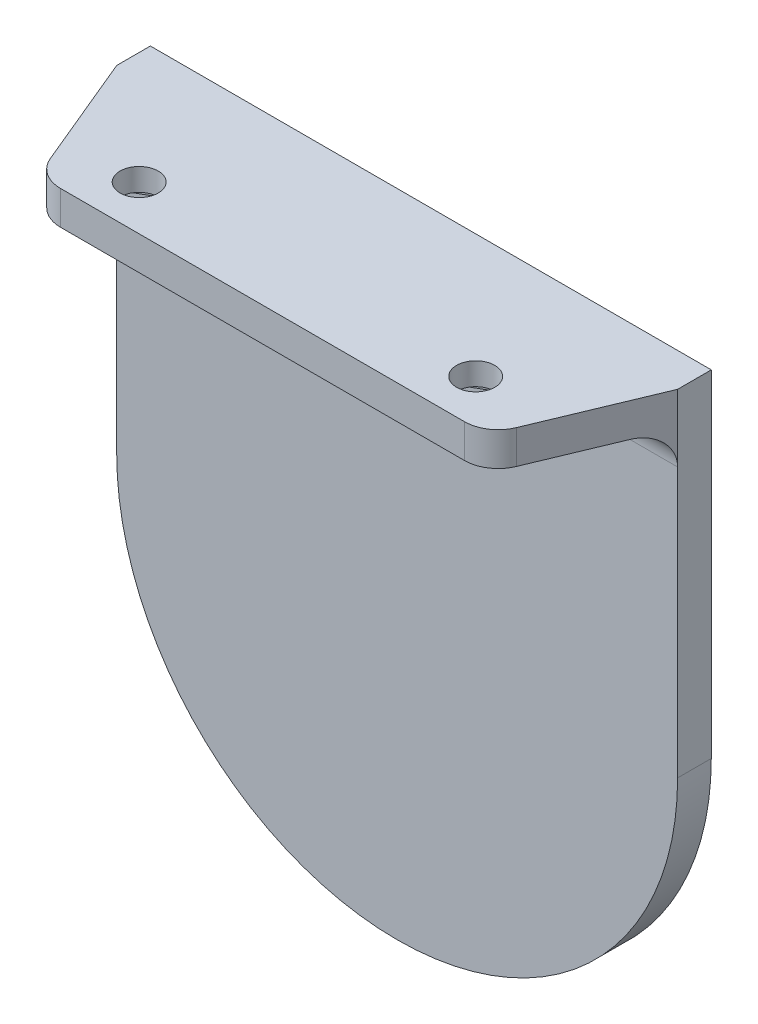
ISO-10303-21;
HEADER;
FILE_DESCRIPTION(('STEP AP214'),'2;1');
FILE_NAME('part.step','',(''),(''),'','','');
FILE_SCHEMA(('AUTOMOTIVE_DESIGN { 1 0 10303 214 1 1 1 1 }'));
ENDSEC;
DATA;
#1=APPLICATION_CONTEXT('core data for automotive mechanical design processes');
#2=APPLICATION_PROTOCOL_DEFINITION('international standard','automotive_design',2000,#1);
#3=PRODUCT_CONTEXT('',#1,'mechanical');
#4=PRODUCT('Part','Part','',(#3));
#5=PRODUCT_RELATED_PRODUCT_CATEGORY('part','',(#4));
#6=PRODUCT_DEFINITION_FORMATION('','',#4);
#7=PRODUCT_DEFINITION_CONTEXT('part definition',#1,'design');
#8=PRODUCT_DEFINITION('design','',#6,#7);
#9=PRODUCT_DEFINITION_SHAPE('','',#8);
#10=(LENGTH_UNIT() NAMED_UNIT(*) SI_UNIT(.MILLI.,.METRE.));
#11=(NAMED_UNIT(*) PLANE_ANGLE_UNIT() SI_UNIT($,.RADIAN.));
#12=(NAMED_UNIT(*) SI_UNIT($,.STERADIAN.) SOLID_ANGLE_UNIT());
#13=UNCERTAINTY_MEASURE_WITH_UNIT(LENGTH_MEASURE(1.E-05),#10,'distance_accuracy_value','');
#14=(GEOMETRIC_REPRESENTATION_CONTEXT(3) GLOBAL_UNCERTAINTY_ASSIGNED_CONTEXT((#13)) GLOBAL_UNIT_ASSIGNED_CONTEXT((#10,
#11,#12)) REPRESENTATION_CONTEXT('',''));
#15=CARTESIAN_POINT('',(0.,0.,0.));
#16=DIRECTION('',(0.,0.,1.));
#17=DIRECTION('',(1.,0.,0.));
#18=AXIS2_PLACEMENT_3D('',#15,#16,#17);
#19=CARTESIAN_POINT('',(880.,174.5,15.));
#20=DIRECTION('',(0.,0.,1.));
#21=DIRECTION('',(1.,0.,0.));
#22=AXIS2_PLACEMENT_3D('',#19,#20,#21);
#23=PLANE('',#22);
#24=DIRECTION('',(1.,0.,0.));
#25=VECTOR('',#24,1.);
#26=CARTESIAN_POINT('',(880.,174.5,15.));
#27=LINE('',#26,#25);
#28=CARTESIAN_POINT('',(882.,174.5,15.));
#29=VERTEX_POINT('',#28);
#30=CARTESIAN_POINT('',(918.,174.5,15.));
#31=VERTEX_POINT('',#30);
#32=EDGE_CURVE('E322',#29,#31,#27,.T.);
#33=ORIENTED_EDGE('',*,*,#32,.T.);
#34=DIRECTION('',(0.,1.,0.));
#35=VECTOR('',#34,1.);
#36=CARTESIAN_POINT('',(918.,174.5,15.));
#37=LINE('',#36,#35);
#38=CARTESIAN_POINT('',(918.,177.5,15.));
#39=VERTEX_POINT('',#38);
#40=EDGE_CURVE('E348',#31,#39,#37,.T.);
#41=ORIENTED_EDGE('',*,*,#40,.T.);
#42=DIRECTION('',(1.,0.,0.));
#43=VECTOR('',#42,1.);
#44=CARTESIAN_POINT('',(880.,177.5,15.));
#45=LINE('',#44,#43);
#46=CARTESIAN_POINT('',(882.,177.5,15.));
#47=VERTEX_POINT('',#46);
#48=EDGE_CURVE('E321',#47,#39,#45,.T.);
#49=ORIENTED_EDGE('',*,*,#48,.F.);
#50=DIRECTION('',(0.,1.,0.));
#51=VECTOR('',#50,1.);
#52=CARTESIAN_POINT('',(882.,174.5,15.));
#53=LINE('',#52,#51);
#54=EDGE_CURVE('E339',#47,#29,#53,.F.);
#55=ORIENTED_EDGE('',*,*,#54,.T.);
#56=EDGE_LOOP('',(#33,#41,#49,#55));
#57=FACE_BOUND('',#56,.T.);
#58=ADVANCED_FACE('F33',(#57),#23,.T.);
#59=CARTESIAN_POINT('',(875.,174.5,3.));
#60=DIRECTION('',(-0.923076923076923,0.,0.384615384615385));
#61=DIRECTION('',(0.384615384615385,0.,0.923076923076923));
#62=AXIS2_PLACEMENT_3D('',#59,#60,#61);
#63=PLANE('',#62);
#64=DIRECTION('',(0.384615384615385,0.,0.923076923076923));
#65=VECTOR('',#64,1.);
#66=CARTESIAN_POINT('',(875.,174.5,3.));
#67=LINE('',#66,#65);
#68=CARTESIAN_POINT('',(876.25,174.5,5.99999999999999));
#69=VERTEX_POINT('',#68);
#70=CARTESIAN_POINT('',(879.230769230769,174.5,13.1538461538462));
#71=VERTEX_POINT('',#70);
#72=EDGE_CURVE('E329',#69,#71,#67,.T.);
#73=ORIENTED_EDGE('',*,*,#72,.T.);
#74=DIRECTION('',(0.,1.,0.));
#75=VECTOR('',#74,1.);
#76=CARTESIAN_POINT('',(879.230769230769,174.5,13.1538461538462));
#77=LINE('',#76,#75);
#78=CARTESIAN_POINT('',(879.230769230769,177.5,13.1538461538462));
#79=VERTEX_POINT('',#78);
#80=EDGE_CURVE('E366',#71,#79,#77,.T.);
#81=ORIENTED_EDGE('',*,*,#80,.T.);
#82=DIRECTION('',(0.384615384615385,0.,0.923076923076923));
#83=VECTOR('',#82,1.);
#84=CARTESIAN_POINT('',(875.,177.5,3.));
#85=LINE('',#84,#83);
#86=CARTESIAN_POINT('',(875.,177.5,3.));
#87=VERTEX_POINT('',#86);
#88=EDGE_CURVE('E326',#87,#79,#85,.T.);
#89=ORIENTED_EDGE('',*,*,#88,.F.);
#90=DIRECTION('',(0.,1.,0.));
#91=VECTOR('',#90,1.);
#92=CARTESIAN_POINT('',(875.,174.5,3.));
#93=LINE('',#92,#91);
#94=CARTESIAN_POINT('',(875.,171.5,3.));
#95=VERTEX_POINT('',#94);
#96=EDGE_CURVE('E56',#95,#87,#93,.T.);
#97=ORIENTED_EDGE('',*,*,#96,.F.);
#98=CARTESIAN_POINT('',(876.25,171.5,6.));
#99=DIRECTION('',(-0.923076923076923,0.,0.384615384615385));
#100=DIRECTION('',(-0.384615384615385,0.,-0.923076923076923));
#101=AXIS2_PLACEMENT_3D('',#98,#99,#100);
#102=ELLIPSE('',#101,3.25,3.);
#103=EDGE_CURVE('E41',#95,#69,#102,.F.);
#104=ORIENTED_EDGE('',*,*,#103,.T.);
#105=EDGE_LOOP('',(#73,#81,#89,#97,#104));
#106=FACE_BOUND('',#105,.T.);
#107=ADVANCED_FACE('F369',(#106),#63,.T.);
#108=CARTESIAN_POINT('',(920.,174.5,15.));
#109=DIRECTION('',(0.923076923076923,0.,0.384615384615385));
#110=DIRECTION('',(0.384615384615385,0.,-0.923076923076923));
#111=AXIS2_PLACEMENT_3D('',#108,#109,#110);
#112=PLANE('',#111);
#113=DIRECTION('',(0.384615384615385,0.,-0.923076923076923));
#114=VECTOR('',#113,1.);
#115=CARTESIAN_POINT('',(920.,177.5,15.));
#116=LINE('',#115,#114);
#117=CARTESIAN_POINT('',(920.769230769231,177.5,13.1538461538462));
#118=VERTEX_POINT('',#117);
#119=CARTESIAN_POINT('',(925.,177.5,3.));
#120=VERTEX_POINT('',#119);
#121=EDGE_CURVE('E334',#118,#120,#116,.T.);
#122=ORIENTED_EDGE('',*,*,#121,.F.);
#123=DIRECTION('',(0.,1.,0.));
#124=VECTOR('',#123,1.);
#125=CARTESIAN_POINT('',(920.769230769231,174.5,13.1538461538462));
#126=LINE('',#125,#124);
#127=CARTESIAN_POINT('',(920.769230769231,174.5,13.1538461538462));
#128=VERTEX_POINT('',#127);
#129=EDGE_CURVE('E355',#118,#128,#126,.F.);
#130=ORIENTED_EDGE('',*,*,#129,.T.);
#131=DIRECTION('',(0.384615384615385,0.,-0.923076923076923));
#132=VECTOR('',#131,1.);
#133=CARTESIAN_POINT('',(920.,174.5,15.));
#134=LINE('',#133,#132);
#135=CARTESIAN_POINT('',(923.75,174.5,5.99999999999999));
#136=VERTEX_POINT('',#135);
#137=EDGE_CURVE('E325',#128,#136,#134,.T.);
#138=ORIENTED_EDGE('',*,*,#137,.T.);
#139=CARTESIAN_POINT('',(923.75,171.5,6.));
#140=DIRECTION('',(0.923076923076923,0.,0.384615384615385));
#141=DIRECTION('',(-0.384615384615385,0.,0.923076923076923));
#142=AXIS2_PLACEMENT_3D('',#139,#140,#141);
#143=ELLIPSE('',#142,3.25,3.);
#144=CARTESIAN_POINT('',(925.,171.5,3.));
#145=VERTEX_POINT('',#144);
#146=EDGE_CURVE('E11',#136,#145,#143,.F.);
#147=ORIENTED_EDGE('',*,*,#146,.T.);
#148=DIRECTION('',(0.,1.,0.));
#149=VECTOR('',#148,1.);
#150=CARTESIAN_POINT('',(925.,174.5,3.));
#151=LINE('',#150,#149);
#152=EDGE_CURVE('E48',#145,#120,#151,.T.);
#153=ORIENTED_EDGE('',*,*,#152,.T.);
#154=EDGE_LOOP('',(#122,#130,#138,#147,#153));
#155=FACE_BOUND('',#154,.T.);
#156=ADVANCED_FACE('F383',(#155),#112,.T.);
#157=CARTESIAN_POINT('',(0.,174.5,0.));
#158=DIRECTION('',(0.,1.,0.));
#159=DIRECTION('',(0.,0.,1.));
#160=AXIS2_PLACEMENT_3D('',#157,#158,#159);
#161=PLANE('',#160);
#162=DIRECTION('',(0.866025403784425,0.,-0.500000000000023));
#163=VECTOR('',#162,1.);
#164=CARTESIAN_POINT('',(882.142116167512,174.5,9.35));
#165=LINE('',#164,#163);
#166=CARTESIAN_POINT('',(882.142116167512,174.5,9.35000000000008));
#167=VERTEX_POINT('',#166);
#168=CARTESIAN_POINT('',(885.,174.5,7.70000000000029));
#169=VERTEX_POINT('',#168);
#170=EDGE_CURVE('E225',#167,#169,#165,.T.);
#171=ORIENTED_EDGE('',*,*,#170,.F.);
#172=DIRECTION('',(0.,0.,-1.));
#173=VECTOR('',#172,1.);
#174=CARTESIAN_POINT('',(882.142116167512,174.5,12.6500000000001));
#175=LINE('',#174,#173);
#176=CARTESIAN_POINT('',(882.142116167512,174.5,12.6500000000001));
#177=VERTEX_POINT('',#176);
#178=EDGE_CURVE('E190',#177,#167,#175,.T.);
#179=ORIENTED_EDGE('',*,*,#178,.F.);
#180=DIRECTION('',(-0.866025403784435,0.,-0.500000000000007));
#181=VECTOR('',#180,1.);
#182=CARTESIAN_POINT('',(885.,174.5,14.2999999999998));
#183=LINE('',#182,#181);
#184=CARTESIAN_POINT('',(885.,174.5,14.2999999999998));
#185=VERTEX_POINT('',#184);
#186=EDGE_CURVE('E208',#185,#177,#183,.T.);
#187=ORIENTED_EDGE('',*,*,#186,.F.);
#188=DIRECTION('',(-0.866025403784495,0.,0.499999999999903));
#189=VECTOR('',#188,1.);
#190=CARTESIAN_POINT('',(887.857883832489,174.5,12.65));
#191=LINE('',#190,#189);
#192=CARTESIAN_POINT('',(887.857883832489,174.5,12.65));
#193=VERTEX_POINT('',#192);
#194=EDGE_CURVE('E211',#193,#185,#191,.T.);
#195=ORIENTED_EDGE('',*,*,#194,.F.);
#196=DIRECTION('',(0.,0.,1.));
#197=VECTOR('',#196,1.);
#198=CARTESIAN_POINT('',(887.857883832489,174.5,9.35));
#199=LINE('',#198,#197);
#200=CARTESIAN_POINT('',(887.857883832489,174.5,9.35));
#201=VERTEX_POINT('',#200);
#202=EDGE_CURVE('E231',#201,#193,#199,.T.);
#203=ORIENTED_EDGE('',*,*,#202,.F.);
#204=DIRECTION('',(0.866025403784501,0.,0.499999999999892));
#205=VECTOR('',#204,1.);
#206=CARTESIAN_POINT('',(885.,174.5,7.70000000000029));
#207=LINE('',#206,#205);
#208=EDGE_CURVE('E228',#169,#201,#207,.T.);
#209=ORIENTED_EDGE('',*,*,#208,.F.);
#210=EDGE_LOOP('',(#171,#179,#187,#195,#203,#209));
#211=FACE_BOUND('',#210,.T.);
#212=DIRECTION('',(0.,0.,-1.));
#213=VECTOR('',#212,1.);
#214=CARTESIAN_POINT('',(912.142116167512,174.5,12.65));
#215=LINE('',#214,#213);
#216=CARTESIAN_POINT('',(912.142116167512,174.5,12.65));
#217=VERTEX_POINT('',#216);
#218=CARTESIAN_POINT('',(912.142116167512,174.5,9.35));
#219=VERTEX_POINT('',#218);
#220=EDGE_CURVE('E267',#217,#219,#215,.T.);
#221=ORIENTED_EDGE('',*,*,#220,.F.);
#222=DIRECTION('',(-0.86602540378443,0.,-0.500000000000015));
#223=VECTOR('',#222,1.);
#224=CARTESIAN_POINT('',(915.,174.5,14.2999999999997));
#225=LINE('',#224,#223);
#226=CARTESIAN_POINT('',(915.,174.5,14.2999999999997));
#227=VERTEX_POINT('',#226);
#228=EDGE_CURVE('E238',#227,#217,#225,.T.);
#229=ORIENTED_EDGE('',*,*,#228,.F.);
#230=DIRECTION('',(-0.866025403784401,0.,0.500000000000066));
#231=VECTOR('',#230,1.);
#232=CARTESIAN_POINT('',(917.857883832488,174.5,12.6499999999998));
#233=LINE('',#232,#231);
#234=CARTESIAN_POINT('',(917.857883832488,174.5,12.6499999999998));
#235=VERTEX_POINT('',#234);
#236=EDGE_CURVE('E250',#235,#227,#233,.T.);
#237=ORIENTED_EDGE('',*,*,#236,.F.);
#238=DIRECTION('',(0.,0.,1.));
#239=VECTOR('',#238,1.);
#240=CARTESIAN_POINT('',(917.857883832488,174.5,9.35));
#241=LINE('',#240,#239);
#242=CARTESIAN_POINT('',(917.857883832488,174.5,9.35));
#243=VERTEX_POINT('',#242);
#244=EDGE_CURVE('E276',#243,#235,#241,.T.);
#245=ORIENTED_EDGE('',*,*,#244,.F.);
#246=DIRECTION('',(0.86602540378441,0.,0.50000000000005));
#247=VECTOR('',#246,1.);
#248=CARTESIAN_POINT('',(915.,174.5,7.70000000000017));
#249=LINE('',#248,#247);
#250=CARTESIAN_POINT('',(915.,174.5,7.70000000000017));
#251=VERTEX_POINT('',#250);
#252=EDGE_CURVE('E273',#251,#243,#249,.T.);
#253=ORIENTED_EDGE('',*,*,#252,.F.);
#254=DIRECTION('',(0.866025403784418,0.,-0.500000000000035));
#255=VECTOR('',#254,1.);
#256=CARTESIAN_POINT('',(912.142116167512,174.5,9.35));
#257=LINE('',#256,#255);
#258=EDGE_CURVE('E270',#219,#251,#257,.T.);
#259=ORIENTED_EDGE('',*,*,#258,.F.);
#260=EDGE_LOOP('',(#221,#229,#237,#245,#253,#259));
#261=FACE_BOUND('',#260,.T.);
#262=ORIENTED_EDGE('',*,*,#137,.F.);
#263=CARTESIAN_POINT('',(918.,174.5,12.));
#264=DIRECTION('',(0.,1.,0.));
#265=DIRECTION('',(0.,0.,1.));
#266=AXIS2_PLACEMENT_3D('',#263,#264,#265);
#267=CIRCLE('',#266,3.);
#268=EDGE_CURVE('E361',#128,#31,#267,.F.);
#269=ORIENTED_EDGE('',*,*,#268,.T.);
#270=ORIENTED_EDGE('',*,*,#32,.F.);
#271=CARTESIAN_POINT('',(882.,174.5,12.));
#272=DIRECTION('',(0.,1.,0.));
#273=DIRECTION('',(0.,0.,1.));
#274=AXIS2_PLACEMENT_3D('',#271,#272,#273);
#275=CIRCLE('',#274,3.);
#276=EDGE_CURVE('E357',#29,#71,#275,.F.);
#277=ORIENTED_EDGE('',*,*,#276,.T.);
#278=ORIENTED_EDGE('',*,*,#72,.F.);
#279=DIRECTION('',(-1.,0.,0.));
#280=VECTOR('',#279,1.);
#281=CARTESIAN_POINT('',(0.,174.5,6.));
#282=LINE('',#281,#280);
#283=EDGE_CURVE('E359',#69,#136,#282,.F.);
#284=ORIENTED_EDGE('',*,*,#283,.T.);
#285=EDGE_LOOP('',(#262,#269,#270,#277,#278,#284));
#286=FACE_BOUND('',#285,.T.);
#287=ADVANCED_FACE('F376',(#211,#261,#286),#161,.F.);
#288=CARTESIAN_POINT('',(0.,177.5,0.));
#289=DIRECTION('',(0.,1.,0.));
#290=DIRECTION('',(0.,0.,1.));
#291=AXIS2_PLACEMENT_3D('',#288,#289,#290);
#292=PLANE('',#291);
#293=CARTESIAN_POINT('',(885.,177.5,11.));
#294=DIRECTION('',(0.,1.,0.));
#295=DIRECTION('',(0.,0.,1.));
#296=AXIS2_PLACEMENT_3D('',#293,#294,#295);
#297=CIRCLE('',#296,1.70000000000003);
#298=CARTESIAN_POINT('',(885.,177.5,12.7));
#299=VERTEX_POINT('',#298);
#300=EDGE_CURVE('E346',#299,#299,#297,.T.);
#301=ORIENTED_EDGE('',*,*,#300,.F.);
#302=EDGE_LOOP('',(#301));
#303=FACE_BOUND('',#302,.T.);
#304=CARTESIAN_POINT('',(915.,177.5,11.));
#305=DIRECTION('',(0.,1.,0.));
#306=DIRECTION('',(0.,0.,1.));
#307=AXIS2_PLACEMENT_3D('',#304,#305,#306);
#308=CIRCLE('',#307,1.70000000000003);
#309=CARTESIAN_POINT('',(915.,177.5,12.7));
#310=VERTEX_POINT('',#309);
#311=EDGE_CURVE('E214',#310,#310,#308,.T.);
#312=ORIENTED_EDGE('',*,*,#311,.F.);
#313=EDGE_LOOP('',(#312));
#314=FACE_BOUND('',#313,.T.);
#315=ORIENTED_EDGE('',*,*,#48,.T.);
#316=CARTESIAN_POINT('',(918.,177.5,12.));
#317=DIRECTION('',(0.,1.,0.));
#318=DIRECTION('',(0.,0.,1.));
#319=AXIS2_PLACEMENT_3D('',#316,#317,#318);
#320=CIRCLE('',#319,3.);
#321=EDGE_CURVE('E353',#39,#118,#320,.T.);
#322=ORIENTED_EDGE('',*,*,#321,.T.);
#323=ORIENTED_EDGE('',*,*,#121,.T.);
#324=DIRECTION('',(0.,0.,1.));
#325=VECTOR('',#324,1.);
#326=CARTESIAN_POINT('',(925.,177.5,0.));
#327=LINE('',#326,#325);
#328=CARTESIAN_POINT('',(925.,177.5,0.));
#329=VERTEX_POINT('',#328);
#330=EDGE_CURVE('E313',#329,#120,#327,.T.);
#331=ORIENTED_EDGE('',*,*,#330,.F.);
#332=DIRECTION('',(1.,0.,0.));
#333=VECTOR('',#332,1.);
#334=CARTESIAN_POINT('',(925.,177.5,0.));
#335=LINE('',#334,#333);
#336=CARTESIAN_POINT('',(875.,177.5,0.));
#337=VERTEX_POINT('',#336);
#338=EDGE_CURVE('E300',#337,#329,#335,.T.);
#339=ORIENTED_EDGE('',*,*,#338,.F.);
#340=DIRECTION('',(0.,0.,1.));
#341=VECTOR('',#340,1.);
#342=CARTESIAN_POINT('',(875.,177.5,0.));
#343=LINE('',#342,#341);
#344=EDGE_CURVE('E315',#337,#87,#343,.T.);
#345=ORIENTED_EDGE('',*,*,#344,.T.);
#346=ORIENTED_EDGE('',*,*,#88,.T.);
#347=CARTESIAN_POINT('',(882.,177.5,12.));
#348=DIRECTION('',(0.,1.,0.));
#349=DIRECTION('',(0.,0.,1.));
#350=AXIS2_PLACEMENT_3D('',#347,#348,#349);
#351=CIRCLE('',#350,3.);
#352=EDGE_CURVE('E351',#79,#47,#351,.T.);
#353=ORIENTED_EDGE('',*,*,#352,.T.);
#354=EDGE_LOOP('',(#315,#322,#323,#331,#339,#345,#346,#353));
#355=FACE_BOUND('',#354,.T.);
#356=ADVANCED_FACE('F393',(#303,#314,#355),#292,.T.);
#357=CARTESIAN_POINT('',(900.,147.5,0.));
#358=DIRECTION('',(0.,0.,1.));
#359=DIRECTION('',(1.,0.,0.));
#360=AXIS2_PLACEMENT_3D('',#357,#358,#359);
#361=CYLINDRICAL_SURFACE('',#360,25.);
#362=CARTESIAN_POINT('',(900.,147.5,3.));
#363=DIRECTION('',(0.,0.,-1.));
#364=DIRECTION('',(1.,0.,0.));
#365=AXIS2_PLACEMENT_3D('',#362,#363,#364);
#366=CIRCLE('',#365,25.);
#367=CARTESIAN_POINT('',(925.,147.5,3.));
#368=VERTEX_POINT('',#367);
#369=CARTESIAN_POINT('',(875.,147.5,3.));
#370=VERTEX_POINT('',#369);
#371=EDGE_CURVE('E283',#368,#370,#366,.T.);
#372=ORIENTED_EDGE('',*,*,#371,.T.);
#373=DIRECTION('',(0.,0.,1.));
#374=VECTOR('',#373,1.);
#375=CARTESIAN_POINT('',(875.,147.5,0.));
#376=LINE('',#375,#374);
#377=CARTESIAN_POINT('',(875.,147.5,0.));
#378=VERTEX_POINT('',#377);
#379=EDGE_CURVE('E318',#378,#370,#376,.T.);
#380=ORIENTED_EDGE('',*,*,#379,.F.);
#381=CARTESIAN_POINT('',(900.,147.5,0.));
#382=DIRECTION('',(0.,0.,-1.));
#383=DIRECTION('',(1.,0.,0.));
#384=AXIS2_PLACEMENT_3D('',#381,#382,#383);
#385=CIRCLE('',#384,25.);
#386=CARTESIAN_POINT('',(925.,147.5,0.));
#387=VERTEX_POINT('',#386);
#388=EDGE_CURVE('E294',#387,#378,#385,.T.);
#389=ORIENTED_EDGE('',*,*,#388,.F.);
#390=DIRECTION('',(0.,0.,1.));
#391=VECTOR('',#390,1.);
#392=CARTESIAN_POINT('',(925.,147.5,0.));
#393=LINE('',#392,#391);
#394=EDGE_CURVE('E304',#387,#368,#393,.T.);
#395=ORIENTED_EDGE('',*,*,#394,.T.);
#396=EDGE_LOOP('',(#372,#380,#389,#395));
#397=FACE_BOUND('',#396,.T.);
#398=ADVANCED_FACE('F408',(#397),#361,.T.);
#399=CARTESIAN_POINT('',(875.,177.5,0.));
#400=DIRECTION('',(1.,0.,0.));
#401=DIRECTION('',(0.,0.,-1.));
#402=AXIS2_PLACEMENT_3D('',#399,#400,#401);
#403=PLANE('',#402);
#404=DIRECTION('',(0.,1.,0.));
#405=VECTOR('',#404,1.);
#406=CARTESIAN_POINT('',(875.,177.5,3.));
#407=LINE('',#406,#405);
#408=EDGE_CURVE('E307',#370,#95,#407,.T.);
#409=ORIENTED_EDGE('',*,*,#408,.T.);
#410=ORIENTED_EDGE('',*,*,#96,.T.);
#411=ORIENTED_EDGE('',*,*,#344,.F.);
#412=DIRECTION('',(0.,1.,0.));
#413=VECTOR('',#412,1.);
#414=CARTESIAN_POINT('',(875.,177.5,0.));
#415=LINE('',#414,#413);
#416=EDGE_CURVE('E297',#378,#337,#415,.T.);
#417=ORIENTED_EDGE('',*,*,#416,.F.);
#418=ORIENTED_EDGE('',*,*,#379,.T.);
#419=EDGE_LOOP('',(#409,#410,#411,#417,#418));
#420=FACE_BOUND('',#419,.T.);
#421=ADVANCED_FACE('F397',(#420),#403,.F.);
#422=CARTESIAN_POINT('',(925.,147.5,0.));
#423=DIRECTION('',(-1.,0.,0.));
#424=DIRECTION('',(0.,0.,1.));
#425=AXIS2_PLACEMENT_3D('',#422,#423,#424);
#426=PLANE('',#425);
#427=ORIENTED_EDGE('',*,*,#152,.F.);
#428=DIRECTION('',(0.,-1.,0.));
#429=VECTOR('',#428,1.);
#430=CARTESIAN_POINT('',(925.,147.5,3.));
#431=LINE('',#430,#429);
#432=EDGE_CURVE('E298',#145,#368,#431,.T.);
#433=ORIENTED_EDGE('',*,*,#432,.T.);
#434=ORIENTED_EDGE('',*,*,#394,.F.);
#435=DIRECTION('',(0.,-1.,0.));
#436=VECTOR('',#435,1.);
#437=CARTESIAN_POINT('',(925.,147.5,0.));
#438=LINE('',#437,#436);
#439=EDGE_CURVE('E302',#329,#387,#438,.T.);
#440=ORIENTED_EDGE('',*,*,#439,.F.);
#441=ORIENTED_EDGE('',*,*,#330,.T.);
#442=EDGE_LOOP('',(#427,#433,#434,#440,#441));
#443=FACE_BOUND('',#442,.T.);
#444=ADVANCED_FACE('F411',(#443),#426,.F.);
#445=CARTESIAN_POINT('',(900.,147.5,0.));
#446=DIRECTION('',(0.,0.,1.));
#447=DIRECTION('',(1.,0.,0.));
#448=AXIS2_PLACEMENT_3D('',#445,#446,#447);
#449=PLANE('',#448);
#450=ORIENTED_EDGE('',*,*,#388,.T.);
#451=ORIENTED_EDGE('',*,*,#416,.T.);
#452=ORIENTED_EDGE('',*,*,#338,.T.);
#453=ORIENTED_EDGE('',*,*,#439,.T.);
#454=EDGE_LOOP('',(#450,#451,#452,#453));
#455=FACE_BOUND('',#454,.T.);
#456=ADVANCED_FACE('F402',(#455),#449,.F.);
#457=CARTESIAN_POINT('',(900.,147.5,3.));
#458=DIRECTION('',(0.,0.,1.));
#459=DIRECTION('',(1.,0.,0.));
#460=AXIS2_PLACEMENT_3D('',#457,#458,#459);
#461=PLANE('',#460);
#462=ORIENTED_EDGE('',*,*,#432,.F.);
#463=DIRECTION('',(-1.,0.,0.));
#464=VECTOR('',#463,1.);
#465=CARTESIAN_POINT('',(900.,171.5,3.));
#466=LINE('',#465,#464);
#467=EDGE_CURVE('E363',#145,#95,#466,.T.);
#468=ORIENTED_EDGE('',*,*,#467,.T.);
#469=ORIENTED_EDGE('',*,*,#408,.F.);
#470=ORIENTED_EDGE('',*,*,#371,.F.);
#471=EDGE_LOOP('',(#462,#468,#469,#470));
#472=FACE_BOUND('',#471,.T.);
#473=ADVANCED_FACE('F410',(#472),#461,.T.);
#474=CARTESIAN_POINT('',(915.,175.5,14.2999999999997));
#475=DIRECTION('',(-0.500000000000015,0.,0.86602540378443));
#476=DIRECTION('',(0.86602540378443,0.,0.500000000000015));
#477=AXIS2_PLACEMENT_3D('',#474,#475,#476);
#478=PLANE('',#477);
#479=ORIENTED_EDGE('',*,*,#228,.T.);
#480=DIRECTION('',(0.,-1.,0.));
#481=VECTOR('',#480,1.);
#482=CARTESIAN_POINT('',(912.142116167512,175.5,12.65));
#483=LINE('',#482,#481);
#484=CARTESIAN_POINT('',(912.142116167512,175.5,12.65));
#485=VERTEX_POINT('',#484);
#486=EDGE_CURVE('E265',#485,#217,#483,.T.);
#487=ORIENTED_EDGE('',*,*,#486,.F.);
#488=DIRECTION('',(-0.86602540378443,0.,-0.500000000000015));
#489=VECTOR('',#488,1.);
#490=CARTESIAN_POINT('',(915.,175.5,14.2999999999997));
#491=LINE('',#490,#489);
#492=CARTESIAN_POINT('',(915.,175.5,14.2999999999997));
#493=VERTEX_POINT('',#492);
#494=EDGE_CURVE('E246',#493,#485,#491,.T.);
#495=ORIENTED_EDGE('',*,*,#494,.F.);
#496=DIRECTION('',(0.,-1.,0.));
#497=VECTOR('',#496,1.);
#498=CARTESIAN_POINT('',(915.,175.5,14.2999999999997));
#499=LINE('',#498,#497);
#500=EDGE_CURVE('E281',#493,#227,#499,.T.);
#501=ORIENTED_EDGE('',*,*,#500,.T.);
#502=EDGE_LOOP('',(#479,#487,#495,#501));
#503=FACE_BOUND('',#502,.T.);
#504=ADVANCED_FACE('F457',(#503),#478,.F.);
#505=CARTESIAN_POINT('',(917.857883832488,175.5,12.6499999999998));
#506=DIRECTION('',(0.500000000000066,0.,0.866025403784401));
#507=DIRECTION('',(0.866025403784401,0.,-0.500000000000066));
#508=AXIS2_PLACEMENT_3D('',#505,#506,#507);
#509=PLANE('',#508);
#510=ORIENTED_EDGE('',*,*,#236,.T.);
#511=ORIENTED_EDGE('',*,*,#500,.F.);
#512=DIRECTION('',(-0.866025403784401,0.,0.500000000000066));
#513=VECTOR('',#512,1.);
#514=CARTESIAN_POINT('',(917.857883832488,175.5,12.6499999999998));
#515=LINE('',#514,#513);
#516=CARTESIAN_POINT('',(917.857883832488,175.5,12.6499999999998));
#517=VERTEX_POINT('',#516);
#518=EDGE_CURVE('E262',#517,#493,#515,.T.);
#519=ORIENTED_EDGE('',*,*,#518,.F.);
#520=DIRECTION('',(0.,-1.,0.));
#521=VECTOR('',#520,1.);
#522=CARTESIAN_POINT('',(917.857883832488,175.5,12.6499999999998));
#523=LINE('',#522,#521);
#524=EDGE_CURVE('E284',#517,#235,#523,.T.);
#525=ORIENTED_EDGE('',*,*,#524,.T.);
#526=EDGE_LOOP('',(#510,#511,#519,#525));
#527=FACE_BOUND('',#526,.T.);
#528=ADVANCED_FACE('F640',(#527),#509,.F.);
#529=CARTESIAN_POINT('',(917.857883832488,175.5,9.35));
#530=DIRECTION('',(1.,0.,0.));
#531=DIRECTION('',(0.,0.,-1.));
#532=AXIS2_PLACEMENT_3D('',#529,#530,#531);
#533=PLANE('',#532);
#534=ORIENTED_EDGE('',*,*,#244,.T.);
#535=ORIENTED_EDGE('',*,*,#524,.F.);
#536=DIRECTION('',(0.,0.,1.));
#537=VECTOR('',#536,1.);
#538=CARTESIAN_POINT('',(917.857883832488,175.5,9.35));
#539=LINE('',#538,#537);
#540=CARTESIAN_POINT('',(917.857883832488,175.5,9.35));
#541=VERTEX_POINT('',#540);
#542=EDGE_CURVE('E259',#541,#517,#539,.T.);
#543=ORIENTED_EDGE('',*,*,#542,.F.);
#544=DIRECTION('',(0.,-1.,0.));
#545=VECTOR('',#544,1.);
#546=CARTESIAN_POINT('',(917.857883832488,175.5,9.35));
#547=LINE('',#546,#545);
#548=EDGE_CURVE('E286',#541,#243,#547,.T.);
#549=ORIENTED_EDGE('',*,*,#548,.T.);
#550=EDGE_LOOP('',(#534,#535,#543,#549));
#551=FACE_BOUND('',#550,.T.);
#552=ADVANCED_FACE('F630',(#551),#533,.F.);
#553=CARTESIAN_POINT('',(915.,175.5,7.70000000000017));
#554=DIRECTION('',(0.50000000000005,0.,-0.86602540378441));
#555=DIRECTION('',(-0.86602540378441,0.,-0.50000000000005));
#556=AXIS2_PLACEMENT_3D('',#553,#554,#555);
#557=PLANE('',#556);
#558=ORIENTED_EDGE('',*,*,#252,.T.);
#559=ORIENTED_EDGE('',*,*,#548,.F.);
#560=DIRECTION('',(0.86602540378441,0.,0.50000000000005));
#561=VECTOR('',#560,1.);
#562=CARTESIAN_POINT('',(915.,175.5,7.70000000000017));
#563=LINE('',#562,#561);
#564=CARTESIAN_POINT('',(915.,175.5,7.70000000000017));
#565=VERTEX_POINT('',#564);
#566=EDGE_CURVE('E256',#565,#541,#563,.T.);
#567=ORIENTED_EDGE('',*,*,#566,.F.);
#568=DIRECTION('',(0.,-1.,0.));
#569=VECTOR('',#568,1.);
#570=CARTESIAN_POINT('',(915.,175.5,7.70000000000017));
#571=LINE('',#570,#569);
#572=EDGE_CURVE('E288',#565,#251,#571,.T.);
#573=ORIENTED_EDGE('',*,*,#572,.T.);
#574=EDGE_LOOP('',(#558,#559,#567,#573));
#575=FACE_BOUND('',#574,.T.);
#576=ADVANCED_FACE('F620',(#575),#557,.F.);
#577=CARTESIAN_POINT('',(912.142116167512,175.5,9.35));
#578=DIRECTION('',(-0.500000000000035,0.,-0.866025403784418));
#579=DIRECTION('',(-0.866025403784418,0.,0.500000000000035));
#580=AXIS2_PLACEMENT_3D('',#577,#578,#579);
#581=PLANE('',#580);
#582=ORIENTED_EDGE('',*,*,#258,.T.);
#583=ORIENTED_EDGE('',*,*,#572,.F.);
#584=DIRECTION('',(0.866025403784418,0.,-0.500000000000035));
#585=VECTOR('',#584,1.);
#586=CARTESIAN_POINT('',(912.142116167512,175.5,9.35));
#587=LINE('',#586,#585);
#588=CARTESIAN_POINT('',(912.142116167512,175.5,9.35));
#589=VERTEX_POINT('',#588);
#590=EDGE_CURVE('E253',#589,#565,#587,.T.);
#591=ORIENTED_EDGE('',*,*,#590,.F.);
#592=DIRECTION('',(0.,-1.,0.));
#593=VECTOR('',#592,1.);
#594=CARTESIAN_POINT('',(912.142116167512,175.5,9.35));
#595=LINE('',#594,#593);
#596=EDGE_CURVE('E290',#589,#219,#595,.T.);
#597=ORIENTED_EDGE('',*,*,#596,.T.);
#598=EDGE_LOOP('',(#582,#583,#591,#597));
#599=FACE_BOUND('',#598,.T.);
#600=ADVANCED_FACE('F610',(#599),#581,.F.);
#601=CARTESIAN_POINT('',(912.142116167512,175.5,12.65));
#602=DIRECTION('',(-1.,0.,0.));
#603=DIRECTION('',(0.,0.,1.));
#604=AXIS2_PLACEMENT_3D('',#601,#602,#603);
#605=PLANE('',#604);
#606=ORIENTED_EDGE('',*,*,#220,.T.);
#607=ORIENTED_EDGE('',*,*,#596,.F.);
#608=DIRECTION('',(0.,0.,-1.));
#609=VECTOR('',#608,1.);
#610=CARTESIAN_POINT('',(912.142116167512,175.5,12.65));
#611=LINE('',#610,#609);
#612=EDGE_CURVE('E249',#485,#589,#611,.T.);
#613=ORIENTED_EDGE('',*,*,#612,.F.);
#614=ORIENTED_EDGE('',*,*,#486,.T.);
#615=EDGE_LOOP('',(#606,#607,#613,#614));
#616=FACE_BOUND('',#615,.T.);
#617=ADVANCED_FACE('F546',(#616),#605,.F.);
#618=CARTESIAN_POINT('',(0.,175.5,0.));
#619=DIRECTION('',(0.,-1.,0.));
#620=DIRECTION('',(0.,0.,-1.));
#621=AXIS2_PLACEMENT_3D('',#618,#619,#620);
#622=PLANE('',#621);
#623=CARTESIAN_POINT('',(915.,175.5,11.));
#624=DIRECTION('',(0.,-1.,0.));
#625=DIRECTION('',(0.,0.,-1.));
#626=AXIS2_PLACEMENT_3D('',#623,#624,#625);
#627=CIRCLE('',#626,1.70000000000003);
#628=CARTESIAN_POINT('',(915.,175.5,9.29999999999997));
#629=VERTEX_POINT('',#628);
#630=EDGE_CURVE('E226',#629,#629,#627,.T.);
#631=ORIENTED_EDGE('',*,*,#630,.F.);
#632=EDGE_LOOP('',(#631));
#633=FACE_BOUND('',#632,.T.);
#634=ORIENTED_EDGE('',*,*,#494,.T.);
#635=ORIENTED_EDGE('',*,*,#612,.T.);
#636=ORIENTED_EDGE('',*,*,#590,.T.);
#637=ORIENTED_EDGE('',*,*,#566,.T.);
#638=ORIENTED_EDGE('',*,*,#542,.T.);
#639=ORIENTED_EDGE('',*,*,#518,.T.);
#640=EDGE_LOOP('',(#634,#635,#636,#637,#638,#639));
#641=FACE_BOUND('',#640,.T.);
#642=ADVANCED_FACE('F541',(#633,#641),#622,.T.);
#643=CARTESIAN_POINT('',(882.142116167512,175.5,12.6500000000001));
#644=DIRECTION('',(-1.,0.,0.));
#645=DIRECTION('',(0.,0.,1.));
#646=AXIS2_PLACEMENT_3D('',#643,#644,#645);
#647=PLANE('',#646);
#648=ORIENTED_EDGE('',*,*,#178,.T.);
#649=DIRECTION('',(0.,-1.,0.));
#650=VECTOR('',#649,1.);
#651=CARTESIAN_POINT('',(882.142116167512,175.5,9.35));
#652=LINE('',#651,#650);
#653=CARTESIAN_POINT('',(882.142116167512,175.5,9.35));
#654=VERTEX_POINT('',#653);
#655=EDGE_CURVE('E183',#654,#167,#652,.T.);
#656=ORIENTED_EDGE('',*,*,#655,.F.);
#657=DIRECTION('',(0.,0.,-1.));
#658=VECTOR('',#657,1.);
#659=CARTESIAN_POINT('',(882.142116167512,175.5,12.6500000000001));
#660=LINE('',#659,#658);
#661=CARTESIAN_POINT('',(882.142116167512,175.5,12.6500000000001));
#662=VERTEX_POINT('',#661);
#663=EDGE_CURVE('E187',#662,#654,#660,.T.);
#664=ORIENTED_EDGE('',*,*,#663,.F.);
#665=DIRECTION('',(0.,-1.,0.));
#666=VECTOR('',#665,1.);
#667=CARTESIAN_POINT('',(882.142116167512,175.5,12.6500000000001));
#668=LINE('',#667,#666);
#669=EDGE_CURVE('E236',#662,#177,#668,.T.);
#670=ORIENTED_EDGE('',*,*,#669,.T.);
#671=EDGE_LOOP('',(#648,#656,#664,#670));
#672=FACE_BOUND('',#671,.T.);
#673=ADVANCED_FACE('F185',(#672),#647,.F.);
#674=CARTESIAN_POINT('',(885.,175.5,14.2999999999998));
#675=DIRECTION('',(-0.500000000000007,0.,0.866025403784435));
#676=DIRECTION('',(0.866025403784435,0.,0.500000000000007));
#677=AXIS2_PLACEMENT_3D('',#674,#675,#676);
#678=PLANE('',#677);
#679=ORIENTED_EDGE('',*,*,#186,.T.);
#680=ORIENTED_EDGE('',*,*,#669,.F.);
#681=DIRECTION('',(-0.866025403784435,0.,-0.500000000000007));
#682=VECTOR('',#681,1.);
#683=CARTESIAN_POINT('',(885.,175.5,14.2999999999998));
#684=LINE('',#683,#682);
#685=CARTESIAN_POINT('',(885.,175.5,14.2999999999998));
#686=VERTEX_POINT('',#685);
#687=EDGE_CURVE('E195',#686,#662,#684,.T.);
#688=ORIENTED_EDGE('',*,*,#687,.F.);
#689=DIRECTION('',(0.,-1.,0.));
#690=VECTOR('',#689,1.);
#691=CARTESIAN_POINT('',(885.,175.5,14.2999999999998));
#692=LINE('',#691,#690);
#693=EDGE_CURVE('E239',#686,#185,#692,.T.);
#694=ORIENTED_EDGE('',*,*,#693,.T.);
#695=EDGE_LOOP('',(#679,#680,#688,#694));
#696=FACE_BOUND('',#695,.T.);
#697=ADVANCED_FACE('F587',(#696),#678,.F.);
#698=CARTESIAN_POINT('',(887.857883832489,175.5,12.65));
#699=DIRECTION('',(0.499999999999903,0.,0.866025403784495));
#700=DIRECTION('',(0.866025403784495,0.,-0.499999999999903));
#701=AXIS2_PLACEMENT_3D('',#698,#699,#700);
#702=PLANE('',#701);
#703=ORIENTED_EDGE('',*,*,#194,.T.);
#704=ORIENTED_EDGE('',*,*,#693,.F.);
#705=DIRECTION('',(-0.866025403784495,0.,0.499999999999903));
#706=VECTOR('',#705,1.);
#707=CARTESIAN_POINT('',(887.857883832489,175.5,12.65));
#708=LINE('',#707,#706);
#709=CARTESIAN_POINT('',(887.857883832489,175.5,12.65));
#710=VERTEX_POINT('',#709);
#711=EDGE_CURVE('E221',#710,#686,#708,.T.);
#712=ORIENTED_EDGE('',*,*,#711,.F.);
#713=DIRECTION('',(0.,-1.,0.));
#714=VECTOR('',#713,1.);
#715=CARTESIAN_POINT('',(887.857883832489,175.5,12.65));
#716=LINE('',#715,#714);
#717=EDGE_CURVE('E241',#710,#193,#716,.T.);
#718=ORIENTED_EDGE('',*,*,#717,.T.);
#719=EDGE_LOOP('',(#703,#704,#712,#718));
#720=FACE_BOUND('',#719,.T.);
#721=ADVANCED_FACE('F577',(#720),#702,.F.);
#722=CARTESIAN_POINT('',(887.857883832489,175.5,9.35));
#723=DIRECTION('',(1.,0.,0.));
#724=DIRECTION('',(0.,0.,-1.));
#725=AXIS2_PLACEMENT_3D('',#722,#723,#724);
#726=PLANE('',#725);
#727=ORIENTED_EDGE('',*,*,#202,.T.);
#728=ORIENTED_EDGE('',*,*,#717,.F.);
#729=DIRECTION('',(0.,0.,1.));
#730=VECTOR('',#729,1.);
#731=CARTESIAN_POINT('',(887.857883832489,175.5,9.35));
#732=LINE('',#731,#730);
#733=CARTESIAN_POINT('',(887.857883832489,175.5,9.35));
#734=VERTEX_POINT('',#733);
#735=EDGE_CURVE('E218',#734,#710,#732,.T.);
#736=ORIENTED_EDGE('',*,*,#735,.F.);
#737=DIRECTION('',(0.,-1.,0.));
#738=VECTOR('',#737,1.);
#739=CARTESIAN_POINT('',(887.857883832489,175.5,9.35));
#740=LINE('',#739,#738);
#741=EDGE_CURVE('E243',#734,#201,#740,.T.);
#742=ORIENTED_EDGE('',*,*,#741,.T.);
#743=EDGE_LOOP('',(#727,#728,#736,#742));
#744=FACE_BOUND('',#743,.T.);
#745=ADVANCED_FACE('F567',(#744),#726,.F.);
#746=CARTESIAN_POINT('',(885.,175.5,7.70000000000029));
#747=DIRECTION('',(0.499999999999892,0.,-0.866025403784501));
#748=DIRECTION('',(-0.866025403784501,0.,-0.499999999999892));
#749=AXIS2_PLACEMENT_3D('',#746,#747,#748);
#750=PLANE('',#749);
#751=ORIENTED_EDGE('',*,*,#208,.T.);
#752=ORIENTED_EDGE('',*,*,#741,.F.);
#753=DIRECTION('',(0.866025403784501,0.,0.499999999999892));
#754=VECTOR('',#753,1.);
#755=CARTESIAN_POINT('',(885.,175.5,7.70000000000029));
#756=LINE('',#755,#754);
#757=CARTESIAN_POINT('',(885.,175.5,7.70000000000029));
#758=VERTEX_POINT('',#757);
#759=EDGE_CURVE('E203',#758,#734,#756,.T.);
#760=ORIENTED_EDGE('',*,*,#759,.F.);
#761=DIRECTION('',(0.,-1.,0.));
#762=VECTOR('',#761,1.);
#763=CARTESIAN_POINT('',(885.,175.5,7.70000000000029));
#764=LINE('',#763,#762);
#765=EDGE_CURVE('E194',#758,#169,#764,.T.);
#766=ORIENTED_EDGE('',*,*,#765,.T.);
#767=EDGE_LOOP('',(#751,#752,#760,#766));
#768=FACE_BOUND('',#767,.T.);
#769=ADVANCED_FACE('F558',(#768),#750,.F.);
#770=CARTESIAN_POINT('',(882.142116167512,175.5,9.35));
#771=DIRECTION('',(-0.500000000000023,0.,-0.866025403784425));
#772=DIRECTION('',(-0.866025403784426,0.,0.500000000000023));
#773=AXIS2_PLACEMENT_3D('',#770,#771,#772);
#774=PLANE('',#773);
#775=ORIENTED_EDGE('',*,*,#170,.T.);
#776=ORIENTED_EDGE('',*,*,#765,.F.);
#777=DIRECTION('',(0.866025403784425,0.,-0.500000000000023));
#778=VECTOR('',#777,1.);
#779=CARTESIAN_POINT('',(882.142116167512,175.5,9.35));
#780=LINE('',#779,#778);
#781=EDGE_CURVE('E198',#654,#758,#780,.T.);
#782=ORIENTED_EDGE('',*,*,#781,.F.);
#783=ORIENTED_EDGE('',*,*,#655,.T.);
#784=EDGE_LOOP('',(#775,#776,#782,#783));
#785=FACE_BOUND('',#784,.T.);
#786=ADVANCED_FACE('F199',(#785),#774,.F.);
#787=CARTESIAN_POINT('',(0.,175.5,0.));
#788=DIRECTION('',(0.,-1.,0.));
#789=DIRECTION('',(0.,0.,-1.));
#790=AXIS2_PLACEMENT_3D('',#787,#788,#789);
#791=PLANE('',#790);
#792=CARTESIAN_POINT('',(885.,175.5,11.));
#793=DIRECTION('',(0.,-1.,0.));
#794=DIRECTION('',(0.,0.,-1.));
#795=AXIS2_PLACEMENT_3D('',#792,#793,#794);
#796=CIRCLE('',#795,1.70000000000003);
#797=CARTESIAN_POINT('',(885.,175.5,9.29999999999997));
#798=VERTEX_POINT('',#797);
#799=EDGE_CURVE('E343',#798,#798,#796,.T.);
#800=ORIENTED_EDGE('',*,*,#799,.F.);
#801=EDGE_LOOP('',(#800));
#802=FACE_BOUND('',#801,.T.);
#803=ORIENTED_EDGE('',*,*,#663,.T.);
#804=ORIENTED_EDGE('',*,*,#781,.T.);
#805=ORIENTED_EDGE('',*,*,#759,.T.);
#806=ORIENTED_EDGE('',*,*,#735,.T.);
#807=ORIENTED_EDGE('',*,*,#711,.T.);
#808=ORIENTED_EDGE('',*,*,#687,.T.);
#809=EDGE_LOOP('',(#803,#804,#805,#806,#807,#808));
#810=FACE_BOUND('',#809,.T.);
#811=ADVANCED_FACE('F205',(#802,#810),#791,.T.);
#812=CARTESIAN_POINT('',(915.,177.5,11.));
#813=DIRECTION('',(0.,1.,0.));
#814=DIRECTION('',(0.,0.,1.));
#815=AXIS2_PLACEMENT_3D('',#812,#813,#814);
#816=CYLINDRICAL_SURFACE('',#815,1.70000000000003);
#817=ORIENTED_EDGE('',*,*,#630,.T.);
#818=EDGE_LOOP('',(#817));
#819=FACE_BOUND('',#818,.T.);
#820=ORIENTED_EDGE('',*,*,#311,.T.);
#821=EDGE_LOOP('',(#820));
#822=FACE_BOUND('',#821,.T.);
#823=ADVANCED_FACE('F515',(#819,#822),#816,.F.);
#824=CARTESIAN_POINT('',(885.,177.5,11.));
#825=DIRECTION('',(0.,1.,0.));
#826=DIRECTION('',(0.,0.,1.));
#827=AXIS2_PLACEMENT_3D('',#824,#825,#826);
#828=CYLINDRICAL_SURFACE('',#827,1.70000000000003);
#829=ORIENTED_EDGE('',*,*,#799,.T.);
#830=EDGE_LOOP('',(#829));
#831=FACE_BOUND('',#830,.T.);
#832=ORIENTED_EDGE('',*,*,#300,.T.);
#833=EDGE_LOOP('',(#832));
#834=FACE_BOUND('',#833,.T.);
#835=ADVANCED_FACE('F430',(#831,#834),#828,.F.);
#836=CARTESIAN_POINT('',(918.,174.5,12.));
#837=DIRECTION('',(0.,1.,0.));
#838=DIRECTION('',(0.,0.,1.));
#839=AXIS2_PLACEMENT_3D('',#836,#837,#838);
#840=CYLINDRICAL_SURFACE('',#839,3.);
#841=ORIENTED_EDGE('',*,*,#268,.F.);
#842=ORIENTED_EDGE('',*,*,#129,.F.);
#843=ORIENTED_EDGE('',*,*,#321,.F.);
#844=ORIENTED_EDGE('',*,*,#40,.F.);
#845=EDGE_LOOP('',(#841,#842,#843,#844));
#846=FACE_BOUND('',#845,.T.);
#847=ADVANCED_FACE('F388',(#846),#840,.T.);
#848=CARTESIAN_POINT('',(900.,171.5,6.));
#849=DIRECTION('',(-1.,0.,0.));
#850=DIRECTION('',(0.,0.,1.));
#851=AXIS2_PLACEMENT_3D('',#848,#849,#850);
#852=CYLINDRICAL_SURFACE('',#851,3.);
#853=ORIENTED_EDGE('',*,*,#146,.F.);
#854=ORIENTED_EDGE('',*,*,#283,.F.);
#855=ORIENTED_EDGE('',*,*,#103,.F.);
#856=ORIENTED_EDGE('',*,*,#467,.F.);
#857=EDGE_LOOP('',(#853,#854,#855,#856));
#858=FACE_BOUND('',#857,.T.);
#859=ADVANCED_FACE('F380',(#858),#852,.F.);
#860=CARTESIAN_POINT('',(882.,174.5,12.));
#861=DIRECTION('',(0.,1.,0.));
#862=DIRECTION('',(0.,0.,1.));
#863=AXIS2_PLACEMENT_3D('',#860,#861,#862);
#864=CYLINDRICAL_SURFACE('',#863,3.);
#865=ORIENTED_EDGE('',*,*,#276,.F.);
#866=ORIENTED_EDGE('',*,*,#54,.F.);
#867=ORIENTED_EDGE('',*,*,#352,.F.);
#868=ORIENTED_EDGE('',*,*,#80,.F.);
#869=EDGE_LOOP('',(#865,#866,#867,#868));
#870=FACE_BOUND('',#869,.T.);
#871=ADVANCED_FACE('F35',(#870),#864,.T.);
#872=CLOSED_SHELL('',(#58,#107,#156,#287,#356,#398,#421,#444,#456,#473,#504,#528,#552,#576,#600,
#617,#642,#673,#697,#721,#745,#769,#786,#811,#823,#835,#847,#859,#871));
#873=MANIFOLD_SOLID_BREP('B2',#872);
#874=ADVANCED_BREP_SHAPE_REPRESENTATION('',(#18,#873),#14);
#875=SHAPE_DEFINITION_REPRESENTATION(#9,#874);
ENDSEC;
END-ISO-10303-21;
